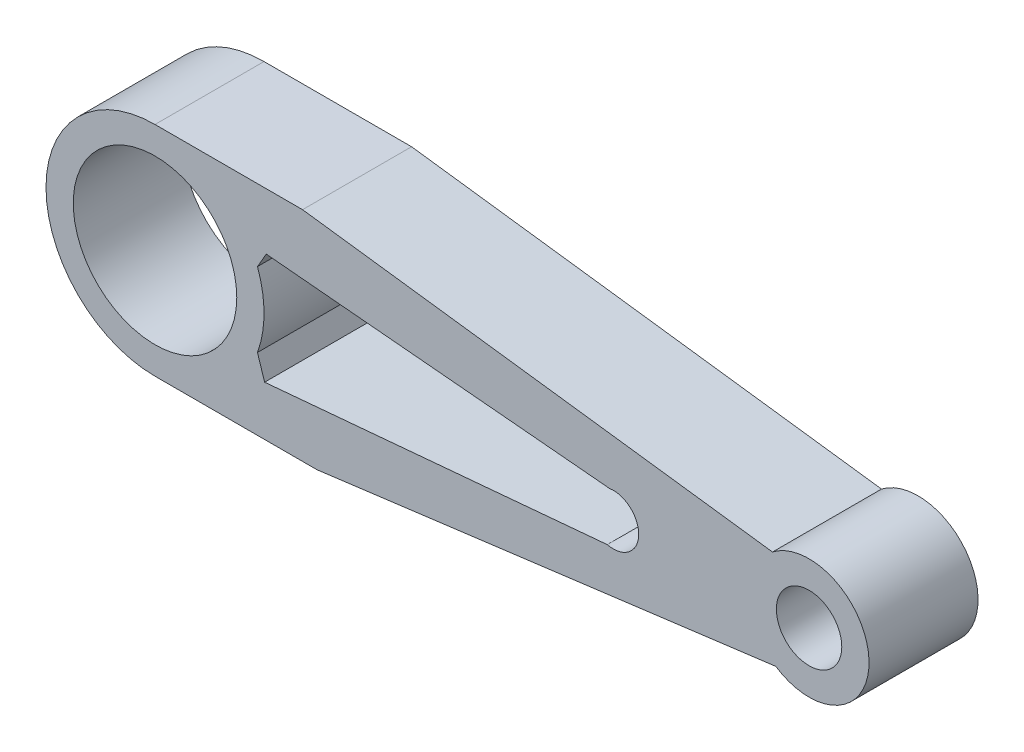
ISO-10303-21;
HEADER;
FILE_DESCRIPTION(('STEP AP214'),'2;1');
FILE_NAME('part.step','',(''),(''),'','','');
FILE_SCHEMA(('AUTOMOTIVE_DESIGN { 1 0 10303 214 1 1 1 1 }'));
ENDSEC;
DATA;
#1=APPLICATION_CONTEXT('core data for automotive mechanical design processes');
#2=APPLICATION_PROTOCOL_DEFINITION('international standard','automotive_design',2000,#1);
#3=PRODUCT_CONTEXT('',#1,'mechanical');
#4=PRODUCT('Part','Part','',(#3));
#5=PRODUCT_RELATED_PRODUCT_CATEGORY('part','',(#4));
#6=PRODUCT_DEFINITION_FORMATION('','',#4);
#7=PRODUCT_DEFINITION_CONTEXT('part definition',#1,'design');
#8=PRODUCT_DEFINITION('design','',#6,#7);
#9=PRODUCT_DEFINITION_SHAPE('','',#8);
#10=(LENGTH_UNIT() NAMED_UNIT(*) SI_UNIT(.MILLI.,.METRE.));
#11=(NAMED_UNIT(*) PLANE_ANGLE_UNIT() SI_UNIT($,.RADIAN.));
#12=(NAMED_UNIT(*) SI_UNIT($,.STERADIAN.) SOLID_ANGLE_UNIT());
#13=UNCERTAINTY_MEASURE_WITH_UNIT(LENGTH_MEASURE(1.E-05),#10,'distance_accuracy_value','');
#14=(GEOMETRIC_REPRESENTATION_CONTEXT(3) GLOBAL_UNCERTAINTY_ASSIGNED_CONTEXT((#13)) GLOBAL_UNIT_ASSIGNED_CONTEXT((#10,
#11,#12)) REPRESENTATION_CONTEXT('',''));
#15=CARTESIAN_POINT('',(0.,0.,0.));
#16=DIRECTION('',(0.,0.,1.));
#17=DIRECTION('',(1.,0.,0.));
#18=AXIS2_PLACEMENT_3D('',#15,#16,#17);
#19=CARTESIAN_POINT('',(0.,0.,20.));
#20=DIRECTION('',(0.,0.,-1.));
#21=DIRECTION('',(-1.,0.,0.));
#22=AXIS2_PLACEMENT_3D('',#19,#20,#21);
#23=CYLINDRICAL_SURFACE('',#22,20.);
#24=CARTESIAN_POINT('',(0.,0.,0.));
#25=DIRECTION('',(0.,0.,1.));
#26=DIRECTION('',(1.,0.,0.));
#27=AXIS2_PLACEMENT_3D('',#24,#25,#26);
#28=CIRCLE('',#27,20.);
#29=CARTESIAN_POINT('',(0.,20.,0.));
#30=VERTEX_POINT('',#29);
#31=CARTESIAN_POINT('',(0.,-20.,0.));
#32=VERTEX_POINT('',#31);
#33=EDGE_CURVE('E185',#30,#32,#28,.T.);
#34=ORIENTED_EDGE('',*,*,#33,.T.);
#35=DIRECTION('',(0.,0.,-1.));
#36=VECTOR('',#35,1.);
#37=CARTESIAN_POINT('',(0.,-20.,20.));
#38=LINE('',#37,#36);
#39=CARTESIAN_POINT('',(0.,-20.,20.));
#40=VERTEX_POINT('',#39);
#41=EDGE_CURVE('E11',#40,#32,#38,.T.);
#42=ORIENTED_EDGE('',*,*,#41,.F.);
#43=CARTESIAN_POINT('',(0.,0.,20.));
#44=DIRECTION('',(0.,0.,1.));
#45=DIRECTION('',(1.,0.,0.));
#46=AXIS2_PLACEMENT_3D('',#43,#44,#45);
#47=CIRCLE('',#46,20.);
#48=CARTESIAN_POINT('',(0.,20.,20.));
#49=VERTEX_POINT('',#48);
#50=EDGE_CURVE('E262',#49,#40,#47,.T.);
#51=ORIENTED_EDGE('',*,*,#50,.F.);
#52=DIRECTION('',(0.,0.,-1.));
#53=VECTOR('',#52,1.);
#54=CARTESIAN_POINT('',(0.,20.,20.));
#55=LINE('',#54,#53);
#56=EDGE_CURVE('E62',#49,#30,#55,.T.);
#57=ORIENTED_EDGE('',*,*,#56,.T.);
#58=EDGE_LOOP('',(#34,#42,#51,#57));
#59=FACE_BOUND('',#58,.T.);
#60=ADVANCED_FACE('F43',(#59),#23,.T.);
#61=CARTESIAN_POINT('',(0.,-20.,20.));
#62=DIRECTION('',(0.,1.,0.));
#63=DIRECTION('',(0.,0.,1.));
#64=AXIS2_PLACEMENT_3D('',#61,#62,#63);
#65=PLANE('',#64);
#66=DIRECTION('',(1.,0.,0.));
#67=VECTOR('',#66,1.);
#68=CARTESIAN_POINT('',(0.,-20.,0.));
#69=LINE('',#68,#67);
#70=CARTESIAN_POINT('',(29.7332507189667,-20.,0.));
#71=VERTEX_POINT('',#70);
#72=EDGE_CURVE('E196',#32,#71,#69,.T.);
#73=ORIENTED_EDGE('',*,*,#72,.T.);
#74=DIRECTION('',(0.,0.,-1.));
#75=VECTOR('',#74,1.);
#76=CARTESIAN_POINT('',(29.7332507189667,-20.,20.));
#77=LINE('',#76,#75);
#78=CARTESIAN_POINT('',(29.7332507189667,-20.,20.));
#79=VERTEX_POINT('',#78);
#80=EDGE_CURVE('E53',#79,#71,#77,.T.);
#81=ORIENTED_EDGE('',*,*,#80,.F.);
#82=DIRECTION('',(1.,0.,0.));
#83=VECTOR('',#82,1.);
#84=CARTESIAN_POINT('',(0.,-20.,20.));
#85=LINE('',#84,#83);
#86=EDGE_CURVE('E267',#40,#79,#85,.T.);
#87=ORIENTED_EDGE('',*,*,#86,.F.);
#88=ORIENTED_EDGE('',*,*,#41,.T.);
#89=EDGE_LOOP('',(#73,#81,#87,#88));
#90=FACE_BOUND('',#89,.T.);
#91=ADVANCED_FACE('F271',(#90),#65,.F.);
#92=CARTESIAN_POINT('',(3.01988700226949,-23.4414039398774,20.));
#93=DIRECTION('',(-0.127771145519485,0.991803677333694,0.));
#94=DIRECTION('',(-0.991803677333694,-0.127771145519485,0.));
#95=AXIS2_PLACEMENT_3D('',#92,#93,#94);
#96=PLANE('',#95);
#97=DIRECTION('',(0.991803677333694,0.127771145519485,0.));
#98=VECTOR('',#97,1.);
#99=CARTESIAN_POINT('',(3.01988700226949,-23.4414039398774,0.));
#100=LINE('',#99,#98);
#101=CARTESIAN_POINT('',(113.904224342289,-9.15650146785664,0.));
#102=VERTEX_POINT('',#101);
#103=EDGE_CURVE('E198',#71,#102,#100,.T.);
#104=ORIENTED_EDGE('',*,*,#103,.T.);
#105=DIRECTION('',(0.,0.,-1.));
#106=VECTOR('',#105,1.);
#107=CARTESIAN_POINT('',(113.904224342289,-9.15650146785664,20.));
#108=LINE('',#107,#106);
#109=CARTESIAN_POINT('',(113.904224342289,-9.15650146785664,20.));
#110=VERTEX_POINT('',#109);
#111=EDGE_CURVE('E162',#110,#102,#108,.T.);
#112=ORIENTED_EDGE('',*,*,#111,.F.);
#113=DIRECTION('',(0.991803677333694,0.127771145519485,0.));
#114=VECTOR('',#113,1.);
#115=CARTESIAN_POINT('',(3.01988700226949,-23.4414039398774,20.));
#116=LINE('',#115,#114);
#117=EDGE_CURVE('E150',#79,#110,#116,.T.);
#118=ORIENTED_EDGE('',*,*,#117,.F.);
#119=ORIENTED_EDGE('',*,*,#80,.T.);
#120=EDGE_LOOP('',(#104,#112,#118,#119));
#121=FACE_BOUND('',#120,.T.);
#122=ADVANCED_FACE('F274',(#121),#96,.F.);
#123=CARTESIAN_POINT('',(120.,0.,20.));
#124=DIRECTION('',(0.,0.,-1.));
#125=DIRECTION('',(-1.,0.,0.));
#126=AXIS2_PLACEMENT_3D('',#123,#124,#125);
#127=CYLINDRICAL_SURFACE('',#126,11.);
#128=CARTESIAN_POINT('',(120.,0.,0.));
#129=DIRECTION('',(0.,0.,1.));
#130=DIRECTION('',(1.,0.,0.));
#131=AXIS2_PLACEMENT_3D('',#128,#129,#130);
#132=CIRCLE('',#131,11.);
#133=CARTESIAN_POINT('',(113.290863107309,8.71707990987449,0.));
#134=VERTEX_POINT('',#133);
#135=EDGE_CURVE('E159',#102,#134,#132,.T.);
#136=ORIENTED_EDGE('',*,*,#135,.T.);
#137=DIRECTION('',(0.,0.,-1.));
#138=VECTOR('',#137,1.);
#139=CARTESIAN_POINT('',(113.290863107309,8.71707990987449,20.));
#140=LINE('',#139,#138);
#141=CARTESIAN_POINT('',(113.290863107309,8.71707990987449,20.));
#142=VERTEX_POINT('',#141);
#143=EDGE_CURVE('E156',#142,#134,#140,.T.);
#144=ORIENTED_EDGE('',*,*,#143,.F.);
#145=CARTESIAN_POINT('',(120.,0.,20.));
#146=DIRECTION('',(0.,0.,1.));
#147=DIRECTION('',(1.,0.,0.));
#148=AXIS2_PLACEMENT_3D('',#145,#146,#147);
#149=CIRCLE('',#148,11.);
#150=EDGE_CURVE('E141',#110,#142,#149,.T.);
#151=ORIENTED_EDGE('',*,*,#150,.F.);
#152=ORIENTED_EDGE('',*,*,#111,.T.);
#153=EDGE_LOOP('',(#136,#144,#151,#152));
#154=FACE_BOUND('',#153,.T.);
#155=ADVANCED_FACE('F157',(#154),#127,.T.);
#156=CARTESIAN_POINT('',(3.02889809344118,23.1460125403695,20.));
#157=DIRECTION('',(0.129754201067059,0.99154619020268,0.));
#158=DIRECTION('',(-0.99154619020268,0.129754201067059,0.));
#159=AXIS2_PLACEMENT_3D('',#156,#157,#158);
#160=PLANE('',#159);
#161=DIRECTION('',(0.99154619020268,-0.129754201067059,0.));
#162=VECTOR('',#161,1.);
#163=CARTESIAN_POINT('',(3.02889809344118,23.1460125403695,0.));
#164=LINE('',#163,#162);
#165=CARTESIAN_POINT('',(27.0698672727054,20.,0.));
#166=VERTEX_POINT('',#165);
#167=EDGE_CURVE('E201',#166,#134,#164,.T.);
#168=ORIENTED_EDGE('',*,*,#167,.F.);
#169=DIRECTION('',(0.,0.,-1.));
#170=VECTOR('',#169,1.);
#171=CARTESIAN_POINT('',(27.0698672727054,20.,20.));
#172=LINE('',#171,#170);
#173=CARTESIAN_POINT('',(27.0698672727054,20.,20.));
#174=VERTEX_POINT('',#173);
#175=EDGE_CURVE('E100',#174,#166,#172,.T.);
#176=ORIENTED_EDGE('',*,*,#175,.F.);
#177=DIRECTION('',(0.99154619020268,-0.129754201067059,0.));
#178=VECTOR('',#177,1.);
#179=CARTESIAN_POINT('',(3.02889809344118,23.1460125403695,20.));
#180=LINE('',#179,#178);
#181=EDGE_CURVE('E148',#174,#142,#180,.T.);
#182=ORIENTED_EDGE('',*,*,#181,.T.);
#183=ORIENTED_EDGE('',*,*,#143,.T.);
#184=EDGE_LOOP('',(#168,#176,#182,#183));
#185=FACE_BOUND('',#184,.T.);
#186=ADVANCED_FACE('F164',(#185),#160,.T.);
#187=CARTESIAN_POINT('',(15.0628020839827,4.83090928501513,20.));
#188=DIRECTION('',(-0.952225529823455,-0.305395711090447,0.));
#189=DIRECTION('',(0.305395711090447,-0.952225529823455,0.));
#190=AXIS2_PLACEMENT_3D('',#187,#188,#189);
#191=PLANE('',#190);
#192=DIRECTION('',(-0.305395711090447,0.952225529823455,0.));
#193=VECTOR('',#192,1.);
#194=CARTESIAN_POINT('',(15.0628020839827,4.83090928501513,0.));
#195=LINE('',#194,#193);
#196=CARTESIAN_POINT('',(20.1072599764128,-10.8977385474644,0.));
#197=VERTEX_POINT('',#196);
#198=CARTESIAN_POINT('',(18.8003054780856,-6.82264713514215,0.));
#199=VERTEX_POINT('',#198);
#200=EDGE_CURVE('E178',#197,#199,#195,.T.);
#201=ORIENTED_EDGE('',*,*,#200,.T.);
#202=DIRECTION('',(0.,0.,-1.));
#203=VECTOR('',#202,1.);
#204=CARTESIAN_POINT('',(18.8003054780856,-6.82264713514215,20.));
#205=LINE('',#204,#203);
#206=CARTESIAN_POINT('',(18.8003054780856,-6.82264713514215,20.));
#207=VERTEX_POINT('',#206);
#208=EDGE_CURVE('E47',#207,#199,#205,.T.);
#209=ORIENTED_EDGE('',*,*,#208,.F.);
#210=DIRECTION('',(-0.305395711090447,0.952225529823455,0.));
#211=VECTOR('',#210,1.);
#212=CARTESIAN_POINT('',(15.0628020839827,4.83090928501513,20.));
#213=LINE('',#212,#211);
#214=CARTESIAN_POINT('',(20.1072599764128,-10.8977385474644,20.));
#215=VERTEX_POINT('',#214);
#216=EDGE_CURVE('E212',#215,#207,#213,.T.);
#217=ORIENTED_EDGE('',*,*,#216,.F.);
#218=DIRECTION('',(0.,0.,-1.));
#219=VECTOR('',#218,1.);
#220=CARTESIAN_POINT('',(20.1072599764128,-10.8977385474644,20.));
#221=LINE('',#220,#219);
#222=EDGE_CURVE('E177',#215,#197,#221,.T.);
#223=ORIENTED_EDGE('',*,*,#222,.T.);
#224=EDGE_LOOP('',(#201,#209,#217,#223));
#225=FACE_BOUND('',#224,.T.);
#226=ADVANCED_FACE('F45',(#225),#191,.F.);
#227=CARTESIAN_POINT('',(18.8003054780856,6.82264713514214,0.));
#228=VERTEX_POINT('',#227);
#229=EDGE_CURVE('E181',#199,#228,#28,.T.);
#230=ORIENTED_EDGE('',*,*,#229,.T.);
#231=DIRECTION('',(0.,0.,-1.));
#232=VECTOR('',#231,1.);
#233=CARTESIAN_POINT('',(18.8003054780856,6.82264713514214,20.));
#234=LINE('',#233,#232);
#235=CARTESIAN_POINT('',(18.8003054780856,6.82264713514214,20.));
#236=VERTEX_POINT('',#235);
#237=EDGE_CURVE('E225',#236,#228,#234,.T.);
#238=ORIENTED_EDGE('',*,*,#237,.F.);
#239=EDGE_CURVE('E113',#207,#236,#47,.T.);
#240=ORIENTED_EDGE('',*,*,#239,.F.);
#241=ORIENTED_EDGE('',*,*,#208,.T.);
#242=EDGE_LOOP('',(#230,#238,#240,#241));
#243=FACE_BOUND('',#242,.T.);
#244=ADVANCED_FACE('F230',(#243),#23,.T.);
#245=CARTESIAN_POINT('',(11.1566116589266,-6.43321055359284,20.));
#246=DIRECTION('',(0.86629635052344,-0.499530412557403,0.));
#247=DIRECTION('',(0.499530412557403,0.86629635052344,0.));
#248=AXIS2_PLACEMENT_3D('',#245,#246,#247);
#249=PLANE('',#248);
#250=DIRECTION('',(-0.499530412557403,-0.86629635052344,0.));
#251=VECTOR('',#250,1.);
#252=CARTESIAN_POINT('',(11.1566116589266,-6.43321055359284,0.));
#253=LINE('',#252,#251);
#254=CARTESIAN_POINT('',(20.4106630518093,9.61536376276939,0.));
#255=VERTEX_POINT('',#254);
#256=EDGE_CURVE('E184',#255,#228,#253,.T.);
#257=ORIENTED_EDGE('',*,*,#256,.F.);
#258=DIRECTION('',(0.,0.,-1.));
#259=VECTOR('',#258,1.);
#260=CARTESIAN_POINT('',(20.4106630518093,9.61536376276939,20.));
#261=LINE('',#260,#259);
#262=CARTESIAN_POINT('',(20.4106630518093,9.61536376276939,20.));
#263=VERTEX_POINT('',#262);
#264=EDGE_CURVE('E224',#263,#255,#261,.T.);
#265=ORIENTED_EDGE('',*,*,#264,.F.);
#266=DIRECTION('',(-0.499530412557403,-0.86629635052344,0.));
#267=VECTOR('',#266,1.);
#268=CARTESIAN_POINT('',(11.1566116589266,-6.43321055359284,20.));
#269=LINE('',#268,#267);
#270=EDGE_CURVE('E254',#263,#236,#269,.T.);
#271=ORIENTED_EDGE('',*,*,#270,.T.);
#272=ORIENTED_EDGE('',*,*,#237,.T.);
#273=EDGE_LOOP('',(#257,#265,#271,#272));
#274=FACE_BOUND('',#273,.T.);
#275=ADVANCED_FACE('F251',(#274),#249,.T.);
#276=CARTESIAN_POINT('',(1.04008866842013,11.3849852794003,20.));
#277=DIRECTION('',(0.0909773143387171,0.995852965188995,0.));
#278=DIRECTION('',(-0.995852965188995,0.0909773143387171,0.));
#279=AXIS2_PLACEMENT_3D('',#276,#277,#278);
#280=PLANE('',#279);
#281=DIRECTION('',(0.995852965188995,-0.0909773143387171,0.));
#282=VECTOR('',#281,1.);
#283=CARTESIAN_POINT('',(1.04008866842013,11.3849852794003,0.));
#284=LINE('',#283,#282);
#285=CARTESIAN_POINT('',(83.3866503074873,3.86211866672901,0.));
#286=VERTEX_POINT('',#285);
#287=EDGE_CURVE('E188',#255,#286,#284,.T.);
#288=ORIENTED_EDGE('',*,*,#287,.T.);
#289=DIRECTION('',(0.,0.,-1.));
#290=VECTOR('',#289,1.);
#291=CARTESIAN_POINT('',(83.3866503074873,3.86211866672901,20.));
#292=LINE('',#291,#290);
#293=CARTESIAN_POINT('',(83.3866503074873,3.86211866672901,20.));
#294=VERTEX_POINT('',#293);
#295=EDGE_CURVE('E221',#294,#286,#292,.T.);
#296=ORIENTED_EDGE('',*,*,#295,.F.);
#297=DIRECTION('',(0.995852965188995,-0.0909773143387171,0.));
#298=VECTOR('',#297,1.);
#299=CARTESIAN_POINT('',(1.04008866842013,11.3849852794003,20.));
#300=LINE('',#299,#298);
#301=EDGE_CURVE('E255',#263,#294,#300,.T.);
#302=ORIENTED_EDGE('',*,*,#301,.F.);
#303=ORIENTED_EDGE('',*,*,#264,.T.);
#304=EDGE_LOOP('',(#288,#296,#302,#303));
#305=FACE_BOUND('',#304,.T.);
#306=ADVANCED_FACE('F256',(#305),#280,.F.);
#307=CARTESIAN_POINT('',(84.0880067511091,-0.741423726177246,20.));
#308=DIRECTION('',(0.,0.,-1.));
#309=DIRECTION('',(-1.,0.,0.));
#310=AXIS2_PLACEMENT_3D('',#307,#308,#309);
#311=CYLINDRICAL_SURFACE('',#310,4.65666226221044);
#312=CARTESIAN_POINT('',(84.0880067511091,-0.741423726177246,0.));
#313=DIRECTION('',(0.,0.,1.));
#314=DIRECTION('',(1.,0.,0.));
#315=AXIS2_PLACEMENT_3D('',#312,#313,#314);
#316=CIRCLE('',#315,4.65666226221044);
#317=CARTESIAN_POINT('',(82.9809258,-5.26457254,0.));
#318=VERTEX_POINT('',#317);
#319=EDGE_CURVE('E190',#286,#318,#316,.F.);
#320=ORIENTED_EDGE('',*,*,#319,.T.);
#321=DIRECTION('',(0.,0.,-1.));
#322=VECTOR('',#321,1.);
#323=CARTESIAN_POINT('',(82.9809258,-5.26457254,20.));
#324=LINE('',#323,#322);
#325=CARTESIAN_POINT('',(82.9809258,-5.26457254,20.));
#326=VERTEX_POINT('',#325);
#327=EDGE_CURVE('E219',#326,#318,#324,.T.);
#328=ORIENTED_EDGE('',*,*,#327,.F.);
#329=CARTESIAN_POINT('',(84.0880067511091,-0.741423726177246,20.));
#330=DIRECTION('',(0.,0.,1.));
#331=DIRECTION('',(1.,0.,0.));
#332=AXIS2_PLACEMENT_3D('',#329,#330,#331);
#333=CIRCLE('',#332,4.65666226221044);
#334=EDGE_CURVE('E258',#294,#326,#333,.F.);
#335=ORIENTED_EDGE('',*,*,#334,.F.);
#336=ORIENTED_EDGE('',*,*,#295,.T.);
#337=EDGE_LOOP('',(#320,#328,#335,#336));
#338=FACE_BOUND('',#337,.T.);
#339=ADVANCED_FACE('F247',(#338),#311,.F.);
#340=CARTESIAN_POINT('',(0.,0.,20.));
#341=DIRECTION('',(0.,0.,-1.));
#342=DIRECTION('',(-1.,0.,0.));
#343=AXIS2_PLACEMENT_3D('',#340,#341,#342);
#344=CYLINDRICAL_SURFACE('',#343,15.);
#345=CARTESIAN_POINT('',(0.,0.,20.));
#346=DIRECTION('',(0.,0.,1.));
#347=DIRECTION('',(1.,0.,0.));
#348=AXIS2_PLACEMENT_3D('',#345,#346,#347);
#349=CIRCLE('',#348,15.);
#350=CARTESIAN_POINT('',(15.,0.,20.));
#351=VERTEX_POINT('',#350);
#352=EDGE_CURVE('E168',#351,#351,#349,.T.);
#353=ORIENTED_EDGE('',*,*,#352,.T.);
#354=EDGE_LOOP('',(#353));
#355=FACE_BOUND('',#354,.T.);
#356=CARTESIAN_POINT('',(0.,0.,0.));
#357=DIRECTION('',(0.,0.,1.));
#358=DIRECTION('',(1.,0.,0.));
#359=AXIS2_PLACEMENT_3D('',#356,#357,#358);
#360=CIRCLE('',#359,15.);
#361=CARTESIAN_POINT('',(15.,0.,0.));
#362=VERTEX_POINT('',#361);
#363=EDGE_CURVE('E206',#362,#362,#360,.T.);
#364=ORIENTED_EDGE('',*,*,#363,.F.);
#365=EDGE_LOOP('',(#364));
#366=FACE_BOUND('',#365,.T.);
#367=ADVANCED_FACE('F278',(#355,#366),#344,.F.);
#368=CARTESIAN_POINT('',(0.,20.,20.));
#369=DIRECTION('',(0.,1.,0.));
#370=DIRECTION('',(-1.,0.,0.));
#371=AXIS2_PLACEMENT_3D('',#368,#369,#370);
#372=PLANE('',#371);
#373=DIRECTION('',(1.,0.,0.));
#374=VECTOR('',#373,1.);
#375=CARTESIAN_POINT('',(0.,20.,0.));
#376=LINE('',#375,#374);
#377=EDGE_CURVE('E203',#30,#166,#376,.T.);
#378=ORIENTED_EDGE('',*,*,#377,.F.);
#379=ORIENTED_EDGE('',*,*,#56,.F.);
#380=DIRECTION('',(1.,0.,0.));
#381=VECTOR('',#380,1.);
#382=CARTESIAN_POINT('',(0.,20.,20.));
#383=LINE('',#382,#381);
#384=EDGE_CURVE('E165',#49,#174,#383,.T.);
#385=ORIENTED_EDGE('',*,*,#384,.T.);
#386=ORIENTED_EDGE('',*,*,#175,.T.);
#387=EDGE_LOOP('',(#378,#379,#385,#386));
#388=FACE_BOUND('',#387,.T.);
#389=ADVANCED_FACE('F276',(#388),#372,.T.);
#390=CARTESIAN_POINT('',(1.12872854908587,-12.5981200459439,20.));
#391=DIRECTION('',(-0.0892375479312117,0.996010371451635,0.));
#392=DIRECTION('',(-0.996010371451635,-0.0892375479312117,0.));
#393=AXIS2_PLACEMENT_3D('',#390,#391,#392);
#394=PLANE('',#393);
#395=DIRECTION('',(0.996010371451635,0.0892375479312117,0.));
#396=VECTOR('',#395,1.);
#397=CARTESIAN_POINT('',(1.12872854908587,-12.5981200459439,0.));
#398=LINE('',#397,#396);
#399=EDGE_CURVE('E193',#197,#318,#398,.T.);
#400=ORIENTED_EDGE('',*,*,#399,.F.);
#401=ORIENTED_EDGE('',*,*,#222,.F.);
#402=DIRECTION('',(0.996010371451635,0.0892375479312117,0.));
#403=VECTOR('',#402,1.);
#404=CARTESIAN_POINT('',(1.12872854908587,-12.5981200459439,20.));
#405=LINE('',#404,#403);
#406=EDGE_CURVE('E244',#215,#326,#405,.T.);
#407=ORIENTED_EDGE('',*,*,#406,.T.);
#408=ORIENTED_EDGE('',*,*,#327,.T.);
#409=EDGE_LOOP('',(#400,#401,#407,#408));
#410=FACE_BOUND('',#409,.T.);
#411=ADVANCED_FACE('F240',(#410),#394,.T.);
#412=CARTESIAN_POINT('',(120.,0.,20.));
#413=DIRECTION('',(0.,0.,-1.));
#414=DIRECTION('',(-1.,0.,0.));
#415=AXIS2_PLACEMENT_3D('',#412,#413,#414);
#416=CYLINDRICAL_SURFACE('',#415,6.00000000000002);
#417=CARTESIAN_POINT('',(120.,0.,20.));
#418=DIRECTION('',(0.,0.,1.));
#419=DIRECTION('',(1.,0.,0.));
#420=AXIS2_PLACEMENT_3D('',#417,#418,#419);
#421=CIRCLE('',#420,6.00000000000002);
#422=CARTESIAN_POINT('',(126.,0.,20.));
#423=VERTEX_POINT('',#422);
#424=EDGE_CURVE('E174',#423,#423,#421,.T.);
#425=ORIENTED_EDGE('',*,*,#424,.T.);
#426=EDGE_LOOP('',(#425));
#427=FACE_BOUND('',#426,.T.);
#428=CARTESIAN_POINT('',(120.,0.,0.));
#429=DIRECTION('',(0.,0.,1.));
#430=DIRECTION('',(1.,0.,0.));
#431=AXIS2_PLACEMENT_3D('',#428,#429,#430);
#432=CIRCLE('',#431,6.00000000000002);
#433=CARTESIAN_POINT('',(126.,0.,0.));
#434=VERTEX_POINT('',#433);
#435=EDGE_CURVE('E209',#434,#434,#432,.T.);
#436=ORIENTED_EDGE('',*,*,#435,.F.);
#437=EDGE_LOOP('',(#436));
#438=FACE_BOUND('',#437,.T.);
#439=ADVANCED_FACE('F284',(#427,#438),#416,.F.);
#440=CARTESIAN_POINT('',(0.,0.,20.));
#441=DIRECTION('',(0.,0.,1.));
#442=DIRECTION('',(1.,0.,0.));
#443=AXIS2_PLACEMENT_3D('',#440,#441,#442);
#444=PLANE('',#443);
#445=ORIENTED_EDGE('',*,*,#216,.T.);
#446=ORIENTED_EDGE('',*,*,#239,.T.);
#447=ORIENTED_EDGE('',*,*,#270,.F.);
#448=ORIENTED_EDGE('',*,*,#301,.T.);
#449=ORIENTED_EDGE('',*,*,#334,.T.);
#450=ORIENTED_EDGE('',*,*,#406,.F.);
#451=EDGE_LOOP('',(#445,#446,#447,#448,#449,#450));
#452=FACE_BOUND('',#451,.T.);
#453=ORIENTED_EDGE('',*,*,#50,.T.);
#454=ORIENTED_EDGE('',*,*,#86,.T.);
#455=ORIENTED_EDGE('',*,*,#117,.T.);
#456=ORIENTED_EDGE('',*,*,#150,.T.);
#457=ORIENTED_EDGE('',*,*,#181,.F.);
#458=ORIENTED_EDGE('',*,*,#384,.F.);
#459=EDGE_LOOP('',(#453,#454,#455,#456,#457,#458));
#460=FACE_BOUND('',#459,.T.);
#461=ORIENTED_EDGE('',*,*,#352,.F.);
#462=EDGE_LOOP('',(#461));
#463=FACE_BOUND('',#462,.T.);
#464=ORIENTED_EDGE('',*,*,#424,.F.);
#465=EDGE_LOOP('',(#464));
#466=FACE_BOUND('',#465,.T.);
#467=ADVANCED_FACE('F144',(#452,#460,#463,#466),#444,.T.);
#468=CARTESIAN_POINT('',(0.,0.,0.));
#469=DIRECTION('',(0.,0.,1.));
#470=DIRECTION('',(1.,0.,0.));
#471=AXIS2_PLACEMENT_3D('',#468,#469,#470);
#472=PLANE('',#471);
#473=ORIENTED_EDGE('',*,*,#200,.F.);
#474=ORIENTED_EDGE('',*,*,#399,.T.);
#475=ORIENTED_EDGE('',*,*,#319,.F.);
#476=ORIENTED_EDGE('',*,*,#287,.F.);
#477=ORIENTED_EDGE('',*,*,#256,.T.);
#478=ORIENTED_EDGE('',*,*,#229,.F.);
#479=EDGE_LOOP('',(#473,#474,#475,#476,#477,#478));
#480=FACE_BOUND('',#479,.T.);
#481=ORIENTED_EDGE('',*,*,#33,.F.);
#482=ORIENTED_EDGE('',*,*,#377,.T.);
#483=ORIENTED_EDGE('',*,*,#167,.T.);
#484=ORIENTED_EDGE('',*,*,#135,.F.);
#485=ORIENTED_EDGE('',*,*,#103,.F.);
#486=ORIENTED_EDGE('',*,*,#72,.F.);
#487=EDGE_LOOP('',(#481,#482,#483,#484,#485,#486));
#488=FACE_BOUND('',#487,.T.);
#489=ORIENTED_EDGE('',*,*,#363,.T.);
#490=EDGE_LOOP('',(#489));
#491=FACE_BOUND('',#490,.T.);
#492=ORIENTED_EDGE('',*,*,#435,.T.);
#493=EDGE_LOOP('',(#492));
#494=FACE_BOUND('',#493,.T.);
#495=ADVANCED_FACE('F236',(#480,#488,#491,#494),#472,.F.);
#496=CLOSED_SHELL('',(#60,#91,#122,#155,#186,#226,#244,#275,#306,#339,#367,#389,#411,#439,#467,#495));
#497=MANIFOLD_SOLID_BREP('B2',#496);
#498=ADVANCED_BREP_SHAPE_REPRESENTATION('',(#18,#497),#14);
#499=SHAPE_DEFINITION_REPRESENTATION(#9,#498);
ENDSEC;
END-ISO-10303-21;
